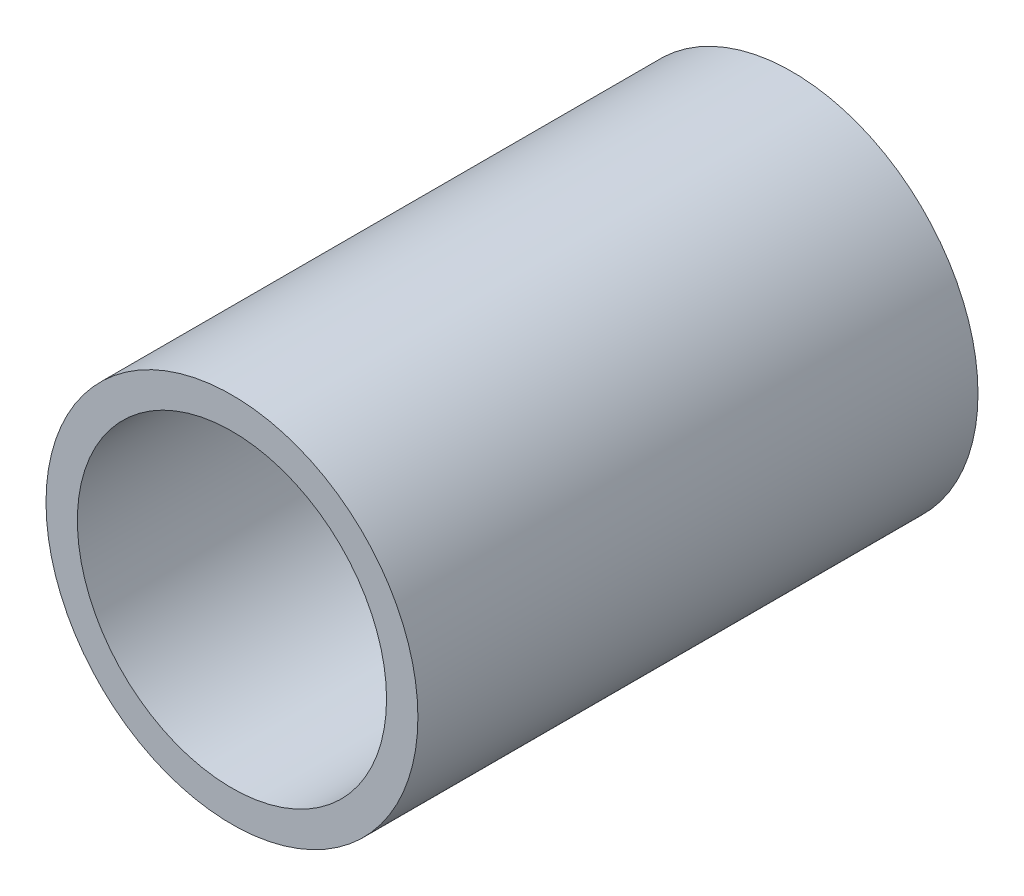
ISO-10303-21;
HEADER;
FILE_DESCRIPTION(('STEP AP214'),'2;1');
FILE_NAME('part.step','',(''),(''),'','','');
FILE_SCHEMA(('AUTOMOTIVE_DESIGN { 1 0 10303 214 1 1 1 1 }'));
ENDSEC;
DATA;
#1=APPLICATION_CONTEXT('core data for automotive mechanical design processes');
#2=APPLICATION_PROTOCOL_DEFINITION('international standard','automotive_design',2000,#1);
#3=PRODUCT_CONTEXT('',#1,'mechanical');
#4=PRODUCT('Part','Part','',(#3));
#5=PRODUCT_RELATED_PRODUCT_CATEGORY('part','',(#4));
#6=PRODUCT_DEFINITION_FORMATION('','',#4);
#7=PRODUCT_DEFINITION_CONTEXT('part definition',#1,'design');
#8=PRODUCT_DEFINITION('design','',#6,#7);
#9=PRODUCT_DEFINITION_SHAPE('','',#8);
#10=(LENGTH_UNIT() NAMED_UNIT(*) SI_UNIT(.MILLI.,.METRE.));
#11=(NAMED_UNIT(*) PLANE_ANGLE_UNIT() SI_UNIT($,.RADIAN.));
#12=(NAMED_UNIT(*) SI_UNIT($,.STERADIAN.) SOLID_ANGLE_UNIT());
#13=UNCERTAINTY_MEASURE_WITH_UNIT(LENGTH_MEASURE(1.E-05),#10,'distance_accuracy_value','');
#14=(GEOMETRIC_REPRESENTATION_CONTEXT(3) GLOBAL_UNCERTAINTY_ASSIGNED_CONTEXT((#13)) GLOBAL_UNIT_ASSIGNED_CONTEXT((#10,
#11,#12)) REPRESENTATION_CONTEXT('',''));
#15=CARTESIAN_POINT('',(0.,0.,0.));
#16=DIRECTION('',(0.,0.,1.));
#17=DIRECTION('',(1.,0.,0.));
#18=AXIS2_PLACEMENT_3D('',#15,#16,#17);
#19=CARTESIAN_POINT('',(0.,0.,31.75));
#20=DIRECTION('',(0.,0.,1.));
#21=DIRECTION('',(1.,0.,0.));
#22=AXIS2_PLACEMENT_3D('',#19,#20,#21);
#23=PLANE('',#22);
#24=CARTESIAN_POINT('',(0.,0.,31.75));
#25=DIRECTION('',(0.,0.,1.));
#26=DIRECTION('',(1.,0.,0.));
#27=AXIS2_PLACEMENT_3D('',#24,#25,#26);
#28=CIRCLE('',#27,21.082);
#29=CARTESIAN_POINT('',(21.082,0.,31.75));
#30=VERTEX_POINT('',#29);
#31=EDGE_CURVE('E11',#30,#30,#28,.T.);
#32=ORIENTED_EDGE('',*,*,#31,.T.);
#33=EDGE_LOOP('',(#32));
#34=FACE_BOUND('',#33,.T.);
#35=CARTESIAN_POINT('',(0.,0.,31.75));
#36=DIRECTION('',(0.,0.,1.));
#37=DIRECTION('',(1.,0.,0.));
#38=AXIS2_PLACEMENT_3D('',#35,#36,#37);
#39=CIRCLE('',#38,17.526);
#40=CARTESIAN_POINT('',(17.526,0.,31.75));
#41=VERTEX_POINT('',#40);
#42=EDGE_CURVE('E48',#41,#41,#39,.T.);
#43=ORIENTED_EDGE('',*,*,#42,.F.);
#44=EDGE_LOOP('',(#43));
#45=FACE_BOUND('',#44,.T.);
#46=ADVANCED_FACE('F37',(#34,#45),#23,.T.);
#47=CARTESIAN_POINT('',(0.,0.,-31.75));
#48=DIRECTION('',(0.,0.,1.));
#49=DIRECTION('',(1.,0.,0.));
#50=AXIS2_PLACEMENT_3D('',#47,#48,#49);
#51=PLANE('',#50);
#52=CARTESIAN_POINT('',(0.,0.,-31.75));
#53=DIRECTION('',(0.,0.,1.));
#54=DIRECTION('',(1.,0.,0.));
#55=AXIS2_PLACEMENT_3D('',#52,#53,#54);
#56=CIRCLE('',#55,21.082);
#57=CARTESIAN_POINT('',(21.082,0.,-31.75));
#58=VERTEX_POINT('',#57);
#59=EDGE_CURVE('E41',#58,#58,#56,.T.);
#60=ORIENTED_EDGE('',*,*,#59,.F.);
#61=EDGE_LOOP('',(#60));
#62=FACE_BOUND('',#61,.T.);
#63=CARTESIAN_POINT('',(0.,0.,-31.75));
#64=DIRECTION('',(0.,0.,1.));
#65=DIRECTION('',(1.,0.,0.));
#66=AXIS2_PLACEMENT_3D('',#63,#64,#65);
#67=CIRCLE('',#66,17.526);
#68=CARTESIAN_POINT('',(17.526,0.,-31.75));
#69=VERTEX_POINT('',#68);
#70=EDGE_CURVE('E50',#69,#69,#67,.T.);
#71=ORIENTED_EDGE('',*,*,#70,.T.);
#72=EDGE_LOOP('',(#71));
#73=FACE_BOUND('',#72,.T.);
#74=ADVANCED_FACE('F60',(#62,#73),#51,.F.);
#75=CARTESIAN_POINT('',(0.,0.,31.75));
#76=DIRECTION('',(0.,0.,-1.));
#77=DIRECTION('',(-1.,0.,0.));
#78=AXIS2_PLACEMENT_3D('',#75,#76,#77);
#79=CYLINDRICAL_SURFACE('',#78,21.082);
#80=ORIENTED_EDGE('',*,*,#31,.F.);
#81=EDGE_LOOP('',(#80));
#82=FACE_BOUND('',#81,.T.);
#83=ORIENTED_EDGE('',*,*,#59,.T.);
#84=EDGE_LOOP('',(#83));
#85=FACE_BOUND('',#84,.T.);
#86=ADVANCED_FACE('F39',(#82,#85),#79,.T.);
#87=CARTESIAN_POINT('',(0.,0.,31.75));
#88=DIRECTION('',(0.,0.,-1.));
#89=DIRECTION('',(-1.,0.,0.));
#90=AXIS2_PLACEMENT_3D('',#87,#88,#89);
#91=CYLINDRICAL_SURFACE('',#90,17.526);
#92=ORIENTED_EDGE('',*,*,#42,.T.);
#93=EDGE_LOOP('',(#92));
#94=FACE_BOUND('',#93,.T.);
#95=ORIENTED_EDGE('',*,*,#70,.F.);
#96=EDGE_LOOP('',(#95));
#97=FACE_BOUND('',#96,.T.);
#98=ADVANCED_FACE('F56',(#94,#97),#91,.F.);
#99=CLOSED_SHELL('',(#46,#74,#86,#98));
#100=MANIFOLD_SOLID_BREP('B2',#99);
#101=ADVANCED_BREP_SHAPE_REPRESENTATION('',(#18,#100),#14);
#102=SHAPE_DEFINITION_REPRESENTATION(#9,#101);
ENDSEC;
END-ISO-10303-21;
